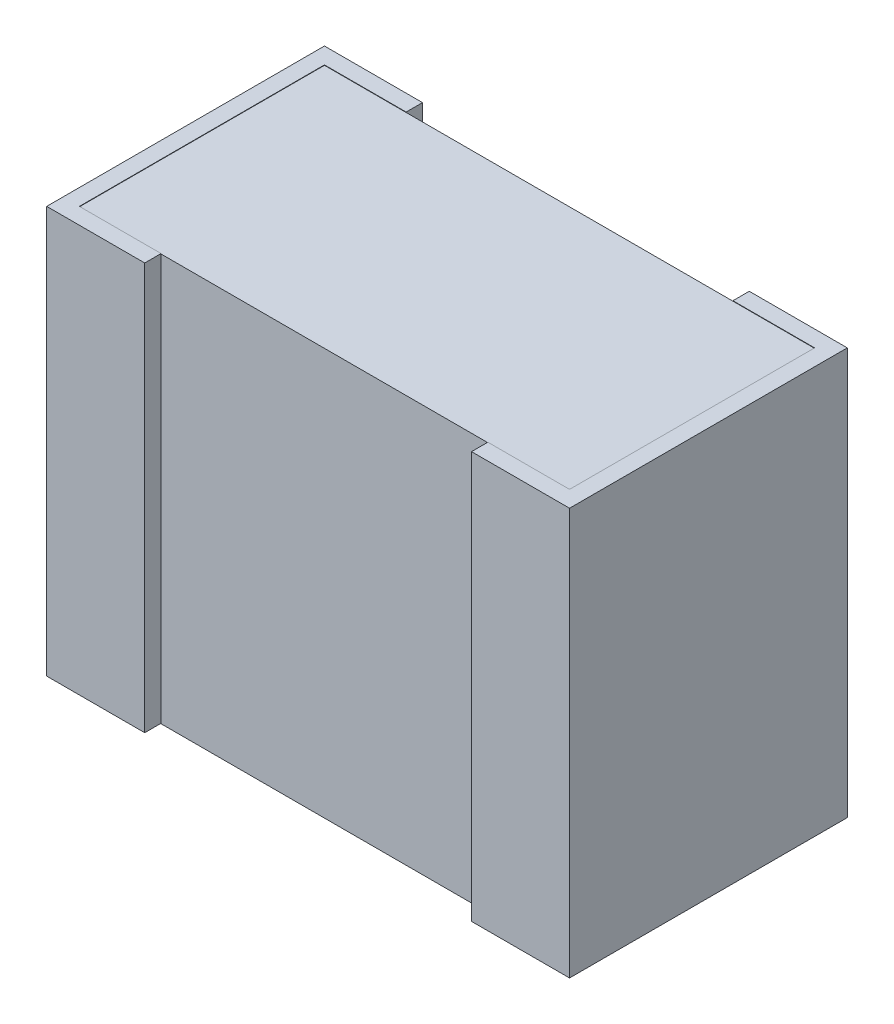
ISO-10303-21;
HEADER;
FILE_DESCRIPTION(('STEP AP214'),'2;1');
FILE_NAME('part.step','',(''),(''),'','','');
FILE_SCHEMA(('AUTOMOTIVE_DESIGN { 1 0 10303 214 1 1 1 1 }'));
ENDSEC;
DATA;
#1=APPLICATION_CONTEXT('core data for automotive mechanical design processes');
#2=APPLICATION_PROTOCOL_DEFINITION('international standard','automotive_design',2000,#1);
#3=PRODUCT_CONTEXT('',#1,'mechanical');
#4=PRODUCT('Part','Part','',(#3));
#5=PRODUCT_RELATED_PRODUCT_CATEGORY('part','',(#4));
#6=PRODUCT_DEFINITION_FORMATION('','',#4);
#7=PRODUCT_DEFINITION_CONTEXT('part definition',#1,'design');
#8=PRODUCT_DEFINITION('design','',#6,#7);
#9=PRODUCT_DEFINITION_SHAPE('','',#8);
#10=(LENGTH_UNIT() NAMED_UNIT(*) SI_UNIT(.MILLI.,.METRE.));
#11=(NAMED_UNIT(*) PLANE_ANGLE_UNIT() SI_UNIT($,.RADIAN.));
#12=(NAMED_UNIT(*) SI_UNIT($,.STERADIAN.) SOLID_ANGLE_UNIT());
#13=UNCERTAINTY_MEASURE_WITH_UNIT(LENGTH_MEASURE(1.E-05),#10,'distance_accuracy_value','');
#14=(GEOMETRIC_REPRESENTATION_CONTEXT(3) GLOBAL_UNCERTAINTY_ASSIGNED_CONTEXT((#13)) GLOBAL_UNIT_ASSIGNED_CONTEXT((#10,
#11,#12)) REPRESENTATION_CONTEXT('',''));
#15=CARTESIAN_POINT('',(0.,0.,0.));
#16=DIRECTION('',(0.,0.,1.));
#17=DIRECTION('',(1.,0.,0.));
#18=AXIS2_PLACEMENT_3D('',#15,#16,#17);
#19=CARTESIAN_POINT('',(-1.5,1.245,0.75));
#20=DIRECTION('',(0.,0.,-1.));
#21=DIRECTION('',(-1.,0.,0.));
#22=AXIS2_PLACEMENT_3D('',#19,#20,#21);
#23=PLANE('',#22);
#24=DIRECTION('',(0.,1.,0.));
#25=VECTOR('',#24,1.);
#26=CARTESIAN_POINT('',(1.,-1.24246,0.75));
#27=LINE('',#26,#25);
#28=CARTESIAN_POINT('',(1.,-1.24246,0.75));
#29=VERTEX_POINT('',#28);
#30=CARTESIAN_POINT('',(1.,1.245,0.75));
#31=VERTEX_POINT('',#30);
#32=EDGE_CURVE('E313',#29,#31,#27,.T.);
#33=ORIENTED_EDGE('',*,*,#32,.T.);
#34=DIRECTION('',(1.,0.,0.));
#35=VECTOR('',#34,1.);
#36=CARTESIAN_POINT('',(-1.5,1.245,0.75));
#37=LINE('',#36,#35);
#38=CARTESIAN_POINT('',(-1.,1.245,0.75));
#39=VERTEX_POINT('',#38);
#40=EDGE_CURVE('E222',#39,#31,#37,.T.);
#41=ORIENTED_EDGE('',*,*,#40,.F.);
#42=DIRECTION('',(0.,1.,0.));
#43=VECTOR('',#42,1.);
#44=CARTESIAN_POINT('',(-1.,-1.24246,0.75));
#45=LINE('',#44,#43);
#46=CARTESIAN_POINT('',(-1.,-1.24246,0.75));
#47=VERTEX_POINT('',#46);
#48=EDGE_CURVE('E59',#47,#39,#45,.T.);
#49=ORIENTED_EDGE('',*,*,#48,.F.);
#50=DIRECTION('',(1.,0.,0.));
#51=VECTOR('',#50,1.);
#52=CARTESIAN_POINT('',(-1.5,-1.24246,0.75));
#53=LINE('',#52,#51);
#54=CARTESIAN_POINT('',(-1.5,-1.24246,0.75));
#55=VERTEX_POINT('',#54);
#56=EDGE_CURVE('E255',#55,#47,#53,.T.);
#57=ORIENTED_EDGE('',*,*,#56,.F.);
#58=DIRECTION('',(0.,-1.,0.));
#59=VECTOR('',#58,1.);
#60=CARTESIAN_POINT('',(-1.5,1.245,0.75));
#61=LINE('',#60,#59);
#62=CARTESIAN_POINT('',(-1.5,-1.245,0.75));
#63=VERTEX_POINT('',#62);
#64=EDGE_CURVE('E11',#55,#63,#61,.T.);
#65=ORIENTED_EDGE('',*,*,#64,.T.);
#66=DIRECTION('',(1.,0.,0.));
#67=VECTOR('',#66,1.);
#68=CARTESIAN_POINT('',(-1.5,-1.245,0.75));
#69=LINE('',#68,#67);
#70=CARTESIAN_POINT('',(1.5,-1.245,0.75));
#71=VERTEX_POINT('',#70);
#72=EDGE_CURVE('E205',#63,#71,#69,.T.);
#73=ORIENTED_EDGE('',*,*,#72,.T.);
#74=DIRECTION('',(0.,-1.,0.));
#75=VECTOR('',#74,1.);
#76=CARTESIAN_POINT('',(1.5,1.245,0.75));
#77=LINE('',#76,#75);
#78=CARTESIAN_POINT('',(1.5,-1.24246,0.75));
#79=VERTEX_POINT('',#78);
#80=EDGE_CURVE('E43',#79,#71,#77,.T.);
#81=ORIENTED_EDGE('',*,*,#80,.F.);
#82=DIRECTION('',(-1.,0.,0.));
#83=VECTOR('',#82,1.);
#84=CARTESIAN_POINT('',(1.5,-1.24246,0.75));
#85=LINE('',#84,#83);
#86=EDGE_CURVE('E183',#79,#29,#85,.T.);
#87=ORIENTED_EDGE('',*,*,#86,.T.);
#88=EDGE_LOOP('',(#33,#41,#49,#57,#65,#73,#81,#87));
#89=FACE_BOUND('',#88,.T.);
#90=ADVANCED_FACE('F34',(#89),#23,.F.);
#91=CARTESIAN_POINT('',(1.5,1.245,-0.75));
#92=DIRECTION('',(1.,0.,0.));
#93=DIRECTION('',(0.,0.,-1.));
#94=AXIS2_PLACEMENT_3D('',#91,#92,#93);
#95=PLANE('',#94);
#96=DIRECTION('',(0.,-1.,0.));
#97=VECTOR('',#96,1.);
#98=CARTESIAN_POINT('',(1.5,1.245,-0.75));
#99=LINE('',#98,#97);
#100=CARTESIAN_POINT('',(1.5,-1.24246,-0.75));
#101=VERTEX_POINT('',#100);
#102=CARTESIAN_POINT('',(1.5,-1.245,-0.75));
#103=VERTEX_POINT('',#102);
#104=EDGE_CURVE('E201',#101,#103,#99,.T.);
#105=ORIENTED_EDGE('',*,*,#104,.F.);
#106=DIRECTION('',(0.,0.,1.));
#107=VECTOR('',#106,1.);
#108=CARTESIAN_POINT('',(1.5,-1.24246,-0.75));
#109=LINE('',#108,#107);
#110=EDGE_CURVE('E187',#101,#79,#109,.T.);
#111=ORIENTED_EDGE('',*,*,#110,.T.);
#112=ORIENTED_EDGE('',*,*,#80,.T.);
#113=DIRECTION('',(0.,0.,1.));
#114=VECTOR('',#113,1.);
#115=CARTESIAN_POINT('',(1.5,-1.245,-0.75));
#116=LINE('',#115,#114);
#117=EDGE_CURVE('E211',#103,#71,#116,.T.);
#118=ORIENTED_EDGE('',*,*,#117,.F.);
#119=EDGE_LOOP('',(#105,#111,#112,#118));
#120=FACE_BOUND('',#119,.T.);
#121=ADVANCED_FACE('F198',(#120),#95,.T.);
#122=CARTESIAN_POINT('',(1.5,1.245,-0.75));
#123=DIRECTION('',(0.,0.,1.));
#124=DIRECTION('',(1.,0.,0.));
#125=AXIS2_PLACEMENT_3D('',#122,#123,#124);
#126=PLANE('',#125);
#127=DIRECTION('',(0.,1.,0.));
#128=VECTOR('',#127,1.);
#129=CARTESIAN_POINT('',(1.,-1.24246,-0.75));
#130=LINE('',#129,#128);
#131=CARTESIAN_POINT('',(1.,-1.24246,-0.75));
#132=VERTEX_POINT('',#131);
#133=CARTESIAN_POINT('',(1.,1.245,-0.75));
#134=VERTEX_POINT('',#133);
#135=EDGE_CURVE('E51',#132,#134,#130,.T.);
#136=ORIENTED_EDGE('',*,*,#135,.F.);
#137=DIRECTION('',(1.,0.,0.));
#138=VECTOR('',#137,1.);
#139=CARTESIAN_POINT('',(1.,-1.24246,-0.75));
#140=LINE('',#139,#138);
#141=EDGE_CURVE('E202',#132,#101,#140,.T.);
#142=ORIENTED_EDGE('',*,*,#141,.T.);
#143=ORIENTED_EDGE('',*,*,#104,.T.);
#144=DIRECTION('',(-1.,0.,0.));
#145=VECTOR('',#144,1.);
#146=CARTESIAN_POINT('',(1.5,-1.245,-0.75));
#147=LINE('',#146,#145);
#148=CARTESIAN_POINT('',(-1.5,-1.245,-0.75));
#149=VERTEX_POINT('',#148);
#150=EDGE_CURVE('E213',#103,#149,#147,.T.);
#151=ORIENTED_EDGE('',*,*,#150,.T.);
#152=DIRECTION('',(0.,-1.,0.));
#153=VECTOR('',#152,1.);
#154=CARTESIAN_POINT('',(-1.5,1.245,-0.75));
#155=LINE('',#154,#153);
#156=CARTESIAN_POINT('',(-1.5,-1.24246,-0.75));
#157=VERTEX_POINT('',#156);
#158=EDGE_CURVE('E38',#157,#149,#155,.T.);
#159=ORIENTED_EDGE('',*,*,#158,.F.);
#160=DIRECTION('',(-1.,0.,0.));
#161=VECTOR('',#160,1.);
#162=CARTESIAN_POINT('',(-1.,-1.24246,-0.75));
#163=LINE('',#162,#161);
#164=CARTESIAN_POINT('',(-1.,-1.24246,-0.75));
#165=VERTEX_POINT('',#164);
#166=EDGE_CURVE('E280',#165,#157,#163,.T.);
#167=ORIENTED_EDGE('',*,*,#166,.F.);
#168=DIRECTION('',(0.,1.,0.));
#169=VECTOR('',#168,1.);
#170=CARTESIAN_POINT('',(-1.,-1.24246,-0.75));
#171=LINE('',#170,#169);
#172=CARTESIAN_POINT('',(-1.,1.245,-0.75));
#173=VERTEX_POINT('',#172);
#174=EDGE_CURVE('E243',#165,#173,#171,.T.);
#175=ORIENTED_EDGE('',*,*,#174,.T.);
#176=DIRECTION('',(-1.,0.,0.));
#177=VECTOR('',#176,1.);
#178=CARTESIAN_POINT('',(1.5,1.245,-0.75));
#179=LINE('',#178,#177);
#180=EDGE_CURVE('E229',#134,#173,#179,.T.);
#181=ORIENTED_EDGE('',*,*,#180,.F.);
#182=EDGE_LOOP('',(#136,#142,#143,#151,#159,#167,#175,#181));
#183=FACE_BOUND('',#182,.T.);
#184=ADVANCED_FACE('F348',(#183),#126,.F.);
#185=CARTESIAN_POINT('',(-1.5,1.245,0.75));
#186=DIRECTION('',(-1.,0.,0.));
#187=DIRECTION('',(0.,0.,1.));
#188=AXIS2_PLACEMENT_3D('',#185,#186,#187);
#189=PLANE('',#188);
#190=ORIENTED_EDGE('',*,*,#64,.F.);
#191=DIRECTION('',(0.,0.,1.));
#192=VECTOR('',#191,1.);
#193=CARTESIAN_POINT('',(-1.5,-1.24246,-0.75));
#194=LINE('',#193,#192);
#195=EDGE_CURVE('E251',#157,#55,#194,.T.);
#196=ORIENTED_EDGE('',*,*,#195,.F.);
#197=ORIENTED_EDGE('',*,*,#158,.T.);
#198=DIRECTION('',(0.,0.,-1.));
#199=VECTOR('',#198,1.);
#200=CARTESIAN_POINT('',(-1.5,-1.245,0.75));
#201=LINE('',#200,#199);
#202=EDGE_CURVE('E216',#63,#149,#201,.T.);
#203=ORIENTED_EDGE('',*,*,#202,.F.);
#204=EDGE_LOOP('',(#190,#196,#197,#203));
#205=FACE_BOUND('',#204,.T.);
#206=ADVANCED_FACE('F36',(#205),#189,.T.);
#207=CARTESIAN_POINT('',(-1.5,1.245,0.75));
#208=DIRECTION('',(0.,-1.,0.));
#209=DIRECTION('',(0.,0.,-1.));
#210=AXIS2_PLACEMENT_3D('',#207,#208,#209);
#211=PLANE('',#210);
#212=DIRECTION('',(0.,0.,-1.));
#213=VECTOR('',#212,1.);
#214=CARTESIAN_POINT('',(-1.5,1.245,0.75));
#215=LINE('',#214,#213);
#216=CARTESIAN_POINT('',(-1.5,1.245,0.75));
#217=VERTEX_POINT('',#216);
#218=CARTESIAN_POINT('',(-1.5,1.245,-0.75));
#219=VERTEX_POINT('',#218);
#220=EDGE_CURVE('E210',#217,#219,#215,.T.);
#221=ORIENTED_EDGE('',*,*,#220,.F.);
#222=EDGE_CURVE('E219',#217,#39,#37,.T.);
#223=ORIENTED_EDGE('',*,*,#222,.T.);
#224=ORIENTED_EDGE('',*,*,#40,.T.);
#225=CARTESIAN_POINT('',(1.5,1.245,0.75));
#226=VERTEX_POINT('',#225);
#227=EDGE_CURVE('E223',#31,#226,#37,.T.);
#228=ORIENTED_EDGE('',*,*,#227,.T.);
#229=DIRECTION('',(0.,0.,1.));
#230=VECTOR('',#229,1.);
#231=CARTESIAN_POINT('',(1.5,1.245,-0.75));
#232=LINE('',#231,#230);
#233=CARTESIAN_POINT('',(1.5,1.245,-0.75));
#234=VERTEX_POINT('',#233);
#235=EDGE_CURVE('E224',#234,#226,#232,.T.);
#236=ORIENTED_EDGE('',*,*,#235,.F.);
#237=EDGE_CURVE('E226',#234,#134,#179,.T.);
#238=ORIENTED_EDGE('',*,*,#237,.T.);
#239=ORIENTED_EDGE('',*,*,#180,.T.);
#240=EDGE_CURVE('E230',#173,#219,#179,.T.);
#241=ORIENTED_EDGE('',*,*,#240,.T.);
#242=EDGE_LOOP('',(#221,#223,#224,#228,#236,#238,#239,#241));
#243=FACE_BOUND('',#242,.T.);
#244=ADVANCED_FACE('F375',(#243),#211,.F.);
#245=CARTESIAN_POINT('',(-1.5,-1.245,0.75));
#246=DIRECTION('',(0.,-1.,0.));
#247=DIRECTION('',(0.,0.,-1.));
#248=AXIS2_PLACEMENT_3D('',#245,#246,#247);
#249=PLANE('',#248);
#250=ORIENTED_EDGE('',*,*,#202,.T.);
#251=ORIENTED_EDGE('',*,*,#150,.F.);
#252=ORIENTED_EDGE('',*,*,#117,.T.);
#253=ORIENTED_EDGE('',*,*,#72,.F.);
#254=EDGE_LOOP('',(#250,#251,#252,#253));
#255=FACE_BOUND('',#254,.T.);
#256=ADVANCED_FACE('F444',(#255),#249,.T.);
#257=CARTESIAN_POINT('',(-1.5,-1.24246,0.75));
#258=DIRECTION('',(0.,0.,1.));
#259=DIRECTION('',(1.,0.,0.));
#260=AXIS2_PLACEMENT_3D('',#257,#258,#259);
#261=PLANE('',#260);
#262=CARTESIAN_POINT('',(-1.,1.24754,0.75));
#263=VERTEX_POINT('',#262);
#264=EDGE_CURVE('E234',#39,#263,#45,.T.);
#265=ORIENTED_EDGE('',*,*,#264,.F.);
#266=ORIENTED_EDGE('',*,*,#222,.F.);
#267=DIRECTION('',(0.,1.,0.));
#268=VECTOR('',#267,1.);
#269=CARTESIAN_POINT('',(-1.5,-1.24246,0.75));
#270=LINE('',#269,#268);
#271=CARTESIAN_POINT('',(-1.5,1.24754,0.75));
#272=VERTEX_POINT('',#271);
#273=EDGE_CURVE('E249',#217,#272,#270,.T.);
#274=ORIENTED_EDGE('',*,*,#273,.T.);
#275=DIRECTION('',(1.,0.,0.));
#276=VECTOR('',#275,1.);
#277=CARTESIAN_POINT('',(-1.5,1.24754,0.75));
#278=LINE('',#277,#276);
#279=EDGE_CURVE('E274',#272,#263,#278,.T.);
#280=ORIENTED_EDGE('',*,*,#279,.T.);
#281=EDGE_LOOP('',(#265,#266,#274,#280));
#282=FACE_BOUND('',#281,.T.);
#283=ADVANCED_FACE('F381',(#282),#261,.F.);
#284=CARTESIAN_POINT('',(-1.,-1.24246,-0.75));
#285=DIRECTION('',(0.,0.,-1.));
#286=DIRECTION('',(-1.,0.,0.));
#287=AXIS2_PLACEMENT_3D('',#284,#285,#286);
#288=PLANE('',#287);
#289=DIRECTION('',(0.,1.,0.));
#290=VECTOR('',#289,1.);
#291=CARTESIAN_POINT('',(-1.5,-1.24246,-0.75));
#292=LINE('',#291,#290);
#293=CARTESIAN_POINT('',(-1.5,1.24754,-0.75));
#294=VERTEX_POINT('',#293);
#295=EDGE_CURVE('E247',#219,#294,#292,.T.);
#296=ORIENTED_EDGE('',*,*,#295,.F.);
#297=ORIENTED_EDGE('',*,*,#240,.F.);
#298=CARTESIAN_POINT('',(-1.,1.24754,-0.75));
#299=VERTEX_POINT('',#298);
#300=EDGE_CURVE('E246',#173,#299,#171,.T.);
#301=ORIENTED_EDGE('',*,*,#300,.T.);
#302=DIRECTION('',(-1.,0.,0.));
#303=VECTOR('',#302,1.);
#304=CARTESIAN_POINT('',(-1.,1.24754,-0.75));
#305=LINE('',#304,#303);
#306=EDGE_CURVE('E256',#299,#294,#305,.T.);
#307=ORIENTED_EDGE('',*,*,#306,.T.);
#308=EDGE_LOOP('',(#296,#297,#301,#307));
#309=FACE_BOUND('',#308,.T.);
#310=ADVANCED_FACE('F411',(#309),#288,.F.);
#311=CARTESIAN_POINT('',(-1.5,-1.24246,-0.75));
#312=DIRECTION('',(-1.,0.,0.));
#313=DIRECTION('',(0.,0.,1.));
#314=AXIS2_PLACEMENT_3D('',#311,#312,#313);
#315=PLANE('',#314);
#316=ORIENTED_EDGE('',*,*,#273,.F.);
#317=ORIENTED_EDGE('',*,*,#220,.T.);
#318=ORIENTED_EDGE('',*,*,#295,.T.);
#319=DIRECTION('',(0.,0.,1.));
#320=VECTOR('',#319,1.);
#321=CARTESIAN_POINT('',(-1.5,1.24754,-0.75));
#322=LINE('',#321,#320);
#323=EDGE_CURVE('E252',#294,#272,#322,.T.);
#324=ORIENTED_EDGE('',*,*,#323,.T.);
#325=EDGE_LOOP('',(#316,#317,#318,#324));
#326=FACE_BOUND('',#325,.T.);
#327=ADVANCED_FACE('F465',(#326),#315,.F.);
#328=CARTESIAN_POINT('',(-1.,-1.24246,0.85));
#329=DIRECTION('',(1.,0.,0.));
#330=DIRECTION('',(0.,0.,-1.));
#331=AXIS2_PLACEMENT_3D('',#328,#329,#330);
#332=PLANE('',#331);
#333=DIRECTION('',(0.,0.,-1.));
#334=VECTOR('',#333,1.);
#335=CARTESIAN_POINT('',(-1.,1.24754,0.85));
#336=LINE('',#335,#334);
#337=CARTESIAN_POINT('',(-1.,1.24754,0.85));
#338=VERTEX_POINT('',#337);
#339=EDGE_CURVE('E271',#338,#263,#336,.T.);
#340=ORIENTED_EDGE('',*,*,#339,.F.);
#341=DIRECTION('',(0.,1.,0.));
#342=VECTOR('',#341,1.);
#343=CARTESIAN_POINT('',(-1.,-1.24246,0.85));
#344=LINE('',#343,#342);
#345=CARTESIAN_POINT('',(-1.,-1.24246,0.85));
#346=VERTEX_POINT('',#345);
#347=EDGE_CURVE('E235',#346,#338,#344,.T.);
#348=ORIENTED_EDGE('',*,*,#347,.F.);
#349=DIRECTION('',(0.,0.,-1.));
#350=VECTOR('',#349,1.);
#351=CARTESIAN_POINT('',(-1.,-1.24246,0.85));
#352=LINE('',#351,#350);
#353=EDGE_CURVE('E294',#346,#47,#352,.T.);
#354=ORIENTED_EDGE('',*,*,#353,.T.);
#355=ORIENTED_EDGE('',*,*,#48,.T.);
#356=ORIENTED_EDGE('',*,*,#264,.T.);
#357=EDGE_LOOP('',(#340,#348,#354,#355,#356));
#358=FACE_BOUND('',#357,.T.);
#359=ADVANCED_FACE('F385',(#358),#332,.T.);
#360=CARTESIAN_POINT('',(-1.6,-1.24246,0.85));
#361=DIRECTION('',(0.,0.,1.));
#362=DIRECTION('',(1.,0.,0.));
#363=AXIS2_PLACEMENT_3D('',#360,#361,#362);
#364=PLANE('',#363);
#365=DIRECTION('',(1.,0.,0.));
#366=VECTOR('',#365,1.);
#367=CARTESIAN_POINT('',(-1.6,1.24754,0.85));
#368=LINE('',#367,#366);
#369=CARTESIAN_POINT('',(-1.6,1.24754,0.85));
#370=VERTEX_POINT('',#369);
#371=EDGE_CURVE('E268',#370,#338,#368,.T.);
#372=ORIENTED_EDGE('',*,*,#371,.F.);
#373=DIRECTION('',(0.,1.,0.));
#374=VECTOR('',#373,1.);
#375=CARTESIAN_POINT('',(-1.6,-1.24246,0.85));
#376=LINE('',#375,#374);
#377=CARTESIAN_POINT('',(-1.6,-1.24246,0.85));
#378=VERTEX_POINT('',#377);
#379=EDGE_CURVE('E237',#378,#370,#376,.T.);
#380=ORIENTED_EDGE('',*,*,#379,.F.);
#381=DIRECTION('',(1.,0.,0.));
#382=VECTOR('',#381,1.);
#383=CARTESIAN_POINT('',(-1.6,-1.24246,0.85));
#384=LINE('',#383,#382);
#385=EDGE_CURVE('E291',#378,#346,#384,.T.);
#386=ORIENTED_EDGE('',*,*,#385,.T.);
#387=ORIENTED_EDGE('',*,*,#347,.T.);
#388=EDGE_LOOP('',(#372,#380,#386,#387));
#389=FACE_BOUND('',#388,.T.);
#390=ADVANCED_FACE('F392',(#389),#364,.T.);
#391=CARTESIAN_POINT('',(-1.6,-1.24246,0.85));
#392=DIRECTION('',(1.,0.,0.));
#393=DIRECTION('',(0.,0.,-1.));
#394=AXIS2_PLACEMENT_3D('',#391,#392,#393);
#395=PLANE('',#394);
#396=DIRECTION('',(0.,0.,-1.));
#397=VECTOR('',#396,1.);
#398=CARTESIAN_POINT('',(-1.6,1.24754,0.85));
#399=LINE('',#398,#397);
#400=CARTESIAN_POINT('',(-1.6,1.24754,-0.85));
#401=VERTEX_POINT('',#400);
#402=EDGE_CURVE('E265',#370,#401,#399,.T.);
#403=ORIENTED_EDGE('',*,*,#402,.T.);
#404=DIRECTION('',(0.,1.,0.));
#405=VECTOR('',#404,1.);
#406=CARTESIAN_POINT('',(-1.6,-1.24246,-0.85));
#407=LINE('',#406,#405);
#408=CARTESIAN_POINT('',(-1.6,-1.24246,-0.85));
#409=VERTEX_POINT('',#408);
#410=EDGE_CURVE('E239',#409,#401,#407,.T.);
#411=ORIENTED_EDGE('',*,*,#410,.F.);
#412=DIRECTION('',(0.,0.,-1.));
#413=VECTOR('',#412,1.);
#414=CARTESIAN_POINT('',(-1.6,-1.24246,0.85));
#415=LINE('',#414,#413);
#416=EDGE_CURVE('E289',#378,#409,#415,.T.);
#417=ORIENTED_EDGE('',*,*,#416,.F.);
#418=ORIENTED_EDGE('',*,*,#379,.T.);
#419=EDGE_LOOP('',(#403,#411,#417,#418));
#420=FACE_BOUND('',#419,.T.);
#421=ADVANCED_FACE('F397',(#420),#395,.F.);
#422=CARTESIAN_POINT('',(-1.,-1.24246,-0.85));
#423=DIRECTION('',(0.,0.,-1.));
#424=DIRECTION('',(-1.,0.,0.));
#425=AXIS2_PLACEMENT_3D('',#422,#423,#424);
#426=PLANE('',#425);
#427=DIRECTION('',(-1.,0.,0.));
#428=VECTOR('',#427,1.);
#429=CARTESIAN_POINT('',(-1.,1.24754,-0.85));
#430=LINE('',#429,#428);
#431=CARTESIAN_POINT('',(-1.,1.24754,-0.85));
#432=VERTEX_POINT('',#431);
#433=EDGE_CURVE('E262',#432,#401,#430,.T.);
#434=ORIENTED_EDGE('',*,*,#433,.F.);
#435=DIRECTION('',(0.,1.,0.));
#436=VECTOR('',#435,1.);
#437=CARTESIAN_POINT('',(-1.,-1.24246,-0.85));
#438=LINE('',#437,#436);
#439=CARTESIAN_POINT('',(-1.,-1.24246,-0.85));
#440=VERTEX_POINT('',#439);
#441=EDGE_CURVE('E241',#440,#432,#438,.T.);
#442=ORIENTED_EDGE('',*,*,#441,.F.);
#443=DIRECTION('',(-1.,0.,0.));
#444=VECTOR('',#443,1.);
#445=CARTESIAN_POINT('',(-1.,-1.24246,-0.85));
#446=LINE('',#445,#444);
#447=EDGE_CURVE('E286',#440,#409,#446,.T.);
#448=ORIENTED_EDGE('',*,*,#447,.T.);
#449=ORIENTED_EDGE('',*,*,#410,.T.);
#450=EDGE_LOOP('',(#434,#442,#448,#449));
#451=FACE_BOUND('',#450,.T.);
#452=ADVANCED_FACE('F474',(#451),#426,.T.);
#453=CARTESIAN_POINT('',(-1.,-1.24246,-0.75));
#454=DIRECTION('',(1.,0.,0.));
#455=DIRECTION('',(0.,0.,-1.));
#456=AXIS2_PLACEMENT_3D('',#453,#454,#455);
#457=PLANE('',#456);
#458=DIRECTION('',(0.,0.,-1.));
#459=VECTOR('',#458,1.);
#460=CARTESIAN_POINT('',(-1.,1.24754,-0.75));
#461=LINE('',#460,#459);
#462=EDGE_CURVE('E259',#299,#432,#461,.T.);
#463=ORIENTED_EDGE('',*,*,#462,.F.);
#464=ORIENTED_EDGE('',*,*,#300,.F.);
#465=ORIENTED_EDGE('',*,*,#174,.F.);
#466=DIRECTION('',(0.,0.,-1.));
#467=VECTOR('',#466,1.);
#468=CARTESIAN_POINT('',(-1.,-1.24246,-0.75));
#469=LINE('',#468,#467);
#470=EDGE_CURVE('E283',#165,#440,#469,.T.);
#471=ORIENTED_EDGE('',*,*,#470,.T.);
#472=ORIENTED_EDGE('',*,*,#441,.T.);
#473=EDGE_LOOP('',(#463,#464,#465,#471,#472));
#474=FACE_BOUND('',#473,.T.);
#475=ADVANCED_FACE('F404',(#474),#457,.T.);
#476=CARTESIAN_POINT('',(-1.6,-1.24246,0.75));
#477=DIRECTION('',(0.,1.,0.));
#478=DIRECTION('',(0.,0.,1.));
#479=AXIS2_PLACEMENT_3D('',#476,#477,#478);
#480=PLANE('',#479);
#481=ORIENTED_EDGE('',*,*,#56,.T.);
#482=ORIENTED_EDGE('',*,*,#353,.F.);
#483=ORIENTED_EDGE('',*,*,#385,.F.);
#484=ORIENTED_EDGE('',*,*,#416,.T.);
#485=ORIENTED_EDGE('',*,*,#447,.F.);
#486=ORIENTED_EDGE('',*,*,#470,.F.);
#487=ORIENTED_EDGE('',*,*,#166,.T.);
#488=ORIENTED_EDGE('',*,*,#195,.T.);
#489=EDGE_LOOP('',(#481,#482,#483,#484,#485,#486,#487,#488));
#490=FACE_BOUND('',#489,.T.);
#491=ADVANCED_FACE('F389',(#490),#480,.F.);
#492=CARTESIAN_POINT('',(-1.6,1.24754,0.75));
#493=DIRECTION('',(0.,1.,0.));
#494=DIRECTION('',(0.,0.,1.));
#495=AXIS2_PLACEMENT_3D('',#492,#493,#494);
#496=PLANE('',#495);
#497=ORIENTED_EDGE('',*,*,#279,.F.);
#498=ORIENTED_EDGE('',*,*,#323,.F.);
#499=ORIENTED_EDGE('',*,*,#306,.F.);
#500=ORIENTED_EDGE('',*,*,#462,.T.);
#501=ORIENTED_EDGE('',*,*,#433,.T.);
#502=ORIENTED_EDGE('',*,*,#402,.F.);
#503=ORIENTED_EDGE('',*,*,#371,.T.);
#504=ORIENTED_EDGE('',*,*,#339,.T.);
#505=EDGE_LOOP('',(#497,#498,#499,#500,#501,#502,#503,#504));
#506=FACE_BOUND('',#505,.T.);
#507=ADVANCED_FACE('F427',(#506),#496,.T.);
#508=CARTESIAN_POINT('',(1.5,-1.24246,0.75));
#509=DIRECTION('',(0.,0.,-1.));
#510=DIRECTION('',(-1.,0.,0.));
#511=AXIS2_PLACEMENT_3D('',#508,#509,#510);
#512=PLANE('',#511);
#513=ORIENTED_EDGE('',*,*,#227,.F.);
#514=CARTESIAN_POINT('',(1.,1.24754,0.75));
#515=VERTEX_POINT('',#514);
#516=EDGE_CURVE('E315',#31,#515,#27,.T.);
#517=ORIENTED_EDGE('',*,*,#516,.T.);
#518=DIRECTION('',(-1.,0.,0.));
#519=VECTOR('',#518,1.);
#520=CARTESIAN_POINT('',(1.5,1.24754,0.75));
#521=LINE('',#520,#519);
#522=CARTESIAN_POINT('',(1.5,1.24754,0.75));
#523=VERTEX_POINT('',#522);
#524=EDGE_CURVE('E334',#523,#515,#521,.T.);
#525=ORIENTED_EDGE('',*,*,#524,.F.);
#526=DIRECTION('',(0.,1.,0.));
#527=VECTOR('',#526,1.);
#528=CARTESIAN_POINT('',(1.5,-1.24246,0.75));
#529=LINE('',#528,#527);
#530=EDGE_CURVE('E277',#226,#523,#529,.T.);
#531=ORIENTED_EDGE('',*,*,#530,.F.);
#532=EDGE_LOOP('',(#513,#517,#525,#531));
#533=FACE_BOUND('',#532,.T.);
#534=ADVANCED_FACE('F425',(#533),#512,.T.);
#535=CARTESIAN_POINT('',(1.5,-1.24246,-0.75));
#536=DIRECTION('',(-1.,0.,0.));
#537=DIRECTION('',(0.,0.,1.));
#538=AXIS2_PLACEMENT_3D('',#535,#536,#537);
#539=PLANE('',#538);
#540=ORIENTED_EDGE('',*,*,#235,.T.);
#541=ORIENTED_EDGE('',*,*,#530,.T.);
#542=DIRECTION('',(0.,0.,1.));
#543=VECTOR('',#542,1.);
#544=CARTESIAN_POINT('',(1.5,1.24754,-0.75));
#545=LINE('',#544,#543);
#546=CARTESIAN_POINT('',(1.5,1.24754,-0.75));
#547=VERTEX_POINT('',#546);
#548=EDGE_CURVE('E331',#547,#523,#545,.T.);
#549=ORIENTED_EDGE('',*,*,#548,.F.);
#550=DIRECTION('',(0.,1.,0.));
#551=VECTOR('',#550,1.);
#552=CARTESIAN_POINT('',(1.5,-1.24246,-0.75));
#553=LINE('',#552,#551);
#554=EDGE_CURVE('E299',#234,#547,#553,.T.);
#555=ORIENTED_EDGE('',*,*,#554,.F.);
#556=EDGE_LOOP('',(#540,#541,#549,#555));
#557=FACE_BOUND('',#556,.T.);
#558=ADVANCED_FACE('F419',(#557),#539,.T.);
#559=CARTESIAN_POINT('',(1.,-1.24246,-0.75));
#560=DIRECTION('',(0.,0.,1.));
#561=DIRECTION('',(1.,0.,0.));
#562=AXIS2_PLACEMENT_3D('',#559,#560,#561);
#563=PLANE('',#562);
#564=ORIENTED_EDGE('',*,*,#237,.F.);
#565=ORIENTED_EDGE('',*,*,#554,.T.);
#566=DIRECTION('',(1.,0.,0.));
#567=VECTOR('',#566,1.);
#568=CARTESIAN_POINT('',(1.,1.24754,-0.75));
#569=LINE('',#568,#567);
#570=CARTESIAN_POINT('',(1.,1.24754,-0.75));
#571=VERTEX_POINT('',#570);
#572=EDGE_CURVE('E328',#571,#547,#569,.T.);
#573=ORIENTED_EDGE('',*,*,#572,.F.);
#574=EDGE_CURVE('E302',#134,#571,#130,.T.);
#575=ORIENTED_EDGE('',*,*,#574,.F.);
#576=EDGE_LOOP('',(#564,#565,#573,#575));
#577=FACE_BOUND('',#576,.T.);
#578=ADVANCED_FACE('F415',(#577),#563,.T.);
#579=CARTESIAN_POINT('',(1.,-1.24246,-0.75));
#580=DIRECTION('',(1.,0.,0.));
#581=DIRECTION('',(0.,0.,-1.));
#582=AXIS2_PLACEMENT_3D('',#579,#580,#581);
#583=PLANE('',#582);
#584=DIRECTION('',(0.,0.,-1.));
#585=VECTOR('',#584,1.);
#586=CARTESIAN_POINT('',(1.,1.24754,-0.75));
#587=LINE('',#586,#585);
#588=CARTESIAN_POINT('',(1.,1.24754,-0.85));
#589=VERTEX_POINT('',#588);
#590=EDGE_CURVE('E326',#571,#589,#587,.T.);
#591=ORIENTED_EDGE('',*,*,#590,.T.);
#592=DIRECTION('',(0.,1.,0.));
#593=VECTOR('',#592,1.);
#594=CARTESIAN_POINT('',(1.,-1.24246,-0.85));
#595=LINE('',#594,#593);
#596=CARTESIAN_POINT('',(1.,-1.24246,-0.85));
#597=VERTEX_POINT('',#596);
#598=EDGE_CURVE('E303',#597,#589,#595,.T.);
#599=ORIENTED_EDGE('',*,*,#598,.F.);
#600=DIRECTION('',(0.,0.,-1.));
#601=VECTOR('',#600,1.);
#602=CARTESIAN_POINT('',(1.,-1.24246,-0.75));
#603=LINE('',#602,#601);
#604=EDGE_CURVE('E345',#132,#597,#603,.T.);
#605=ORIENTED_EDGE('',*,*,#604,.F.);
#606=ORIENTED_EDGE('',*,*,#135,.T.);
#607=ORIENTED_EDGE('',*,*,#574,.T.);
#608=EDGE_LOOP('',(#591,#599,#605,#606,#607));
#609=FACE_BOUND('',#608,.T.);
#610=ADVANCED_FACE('F355',(#609),#583,.F.);
#611=CARTESIAN_POINT('',(1.,-1.24246,-0.85));
#612=DIRECTION('',(0.,0.,1.));
#613=DIRECTION('',(1.,0.,0.));
#614=AXIS2_PLACEMENT_3D('',#611,#612,#613);
#615=PLANE('',#614);
#616=DIRECTION('',(1.,0.,0.));
#617=VECTOR('',#616,1.);
#618=CARTESIAN_POINT('',(1.,1.24754,-0.85));
#619=LINE('',#618,#617);
#620=CARTESIAN_POINT('',(1.6,1.24754,-0.85));
#621=VERTEX_POINT('',#620);
#622=EDGE_CURVE('E323',#589,#621,#619,.T.);
#623=ORIENTED_EDGE('',*,*,#622,.T.);
#624=DIRECTION('',(0.,1.,0.));
#625=VECTOR('',#624,1.);
#626=CARTESIAN_POINT('',(1.6,-1.24246,-0.85));
#627=LINE('',#626,#625);
#628=CARTESIAN_POINT('',(1.6,-1.24246,-0.85));
#629=VERTEX_POINT('',#628);
#630=EDGE_CURVE('E306',#629,#621,#627,.T.);
#631=ORIENTED_EDGE('',*,*,#630,.F.);
#632=DIRECTION('',(1.,0.,0.));
#633=VECTOR('',#632,1.);
#634=CARTESIAN_POINT('',(1.,-1.24246,-0.85));
#635=LINE('',#634,#633);
#636=EDGE_CURVE('E343',#597,#629,#635,.T.);
#637=ORIENTED_EDGE('',*,*,#636,.F.);
#638=ORIENTED_EDGE('',*,*,#598,.T.);
#639=EDGE_LOOP('',(#623,#631,#637,#638));
#640=FACE_BOUND('',#639,.T.);
#641=ADVANCED_FACE('F359',(#640),#615,.F.);
#642=CARTESIAN_POINT('',(1.6,-1.24246,0.85));
#643=DIRECTION('',(1.,0.,0.));
#644=DIRECTION('',(0.,0.,-1.));
#645=AXIS2_PLACEMENT_3D('',#642,#643,#644);
#646=PLANE('',#645);
#647=DIRECTION('',(0.,0.,-1.));
#648=VECTOR('',#647,1.);
#649=CARTESIAN_POINT('',(1.6,1.24754,0.85));
#650=LINE('',#649,#648);
#651=CARTESIAN_POINT('',(1.6,1.24754,0.85));
#652=VERTEX_POINT('',#651);
#653=EDGE_CURVE('E320',#652,#621,#650,.T.);
#654=ORIENTED_EDGE('',*,*,#653,.F.);
#655=DIRECTION('',(0.,1.,0.));
#656=VECTOR('',#655,1.);
#657=CARTESIAN_POINT('',(1.6,-1.24246,0.85));
#658=LINE('',#657,#656);
#659=CARTESIAN_POINT('',(1.6,-1.24246,0.85));
#660=VERTEX_POINT('',#659);
#661=EDGE_CURVE('E308',#660,#652,#658,.T.);
#662=ORIENTED_EDGE('',*,*,#661,.F.);
#663=DIRECTION('',(0.,0.,-1.));
#664=VECTOR('',#663,1.);
#665=CARTESIAN_POINT('',(1.6,-1.24246,0.85));
#666=LINE('',#665,#664);
#667=EDGE_CURVE('E340',#660,#629,#666,.T.);
#668=ORIENTED_EDGE('',*,*,#667,.T.);
#669=ORIENTED_EDGE('',*,*,#630,.T.);
#670=EDGE_LOOP('',(#654,#662,#668,#669));
#671=FACE_BOUND('',#670,.T.);
#672=ADVANCED_FACE('F362',(#671),#646,.T.);
#673=CARTESIAN_POINT('',(1.6,-1.24246,0.85));
#674=DIRECTION('',(0.,0.,-1.));
#675=DIRECTION('',(-1.,0.,0.));
#676=AXIS2_PLACEMENT_3D('',#673,#674,#675);
#677=PLANE('',#676);
#678=DIRECTION('',(-1.,0.,0.));
#679=VECTOR('',#678,1.);
#680=CARTESIAN_POINT('',(1.6,1.24754,0.85));
#681=LINE('',#680,#679);
#682=CARTESIAN_POINT('',(1.,1.24754,0.85));
#683=VERTEX_POINT('',#682);
#684=EDGE_CURVE('E318',#652,#683,#681,.T.);
#685=ORIENTED_EDGE('',*,*,#684,.T.);
#686=DIRECTION('',(0.,1.,0.));
#687=VECTOR('',#686,1.);
#688=CARTESIAN_POINT('',(1.,-1.24246,0.85));
#689=LINE('',#688,#687);
#690=CARTESIAN_POINT('',(1.,-1.24246,0.85));
#691=VERTEX_POINT('',#690);
#692=EDGE_CURVE('E310',#691,#683,#689,.T.);
#693=ORIENTED_EDGE('',*,*,#692,.F.);
#694=DIRECTION('',(-1.,0.,0.));
#695=VECTOR('',#694,1.);
#696=CARTESIAN_POINT('',(1.6,-1.24246,0.85));
#697=LINE('',#696,#695);
#698=EDGE_CURVE('E338',#660,#691,#697,.T.);
#699=ORIENTED_EDGE('',*,*,#698,.F.);
#700=ORIENTED_EDGE('',*,*,#661,.T.);
#701=EDGE_LOOP('',(#685,#693,#699,#700));
#702=FACE_BOUND('',#701,.T.);
#703=ADVANCED_FACE('F366',(#702),#677,.F.);
#704=CARTESIAN_POINT('',(1.,-1.24246,0.85));
#705=DIRECTION('',(1.,0.,0.));
#706=DIRECTION('',(0.,0.,-1.));
#707=AXIS2_PLACEMENT_3D('',#704,#705,#706);
#708=PLANE('',#707);
#709=DIRECTION('',(0.,0.,-1.));
#710=VECTOR('',#709,1.);
#711=CARTESIAN_POINT('',(1.,1.24754,0.85));
#712=LINE('',#711,#710);
#713=EDGE_CURVE('E194',#683,#515,#712,.T.);
#714=ORIENTED_EDGE('',*,*,#713,.T.);
#715=ORIENTED_EDGE('',*,*,#516,.F.);
#716=ORIENTED_EDGE('',*,*,#32,.F.);
#717=DIRECTION('',(0.,0.,-1.));
#718=VECTOR('',#717,1.);
#719=CARTESIAN_POINT('',(1.,-1.24246,0.85));
#720=LINE('',#719,#718);
#721=EDGE_CURVE('E190',#691,#29,#720,.T.);
#722=ORIENTED_EDGE('',*,*,#721,.F.);
#723=ORIENTED_EDGE('',*,*,#692,.T.);
#724=EDGE_LOOP('',(#714,#715,#716,#722,#723));
#725=FACE_BOUND('',#724,.T.);
#726=ADVANCED_FACE('F370',(#725),#708,.F.);
#727=CARTESIAN_POINT('',(1.6,-1.24246,0.75));
#728=DIRECTION('',(0.,1.,0.));
#729=DIRECTION('',(0.,0.,1.));
#730=AXIS2_PLACEMENT_3D('',#727,#728,#729);
#731=PLANE('',#730);
#732=ORIENTED_EDGE('',*,*,#86,.F.);
#733=ORIENTED_EDGE('',*,*,#110,.F.);
#734=ORIENTED_EDGE('',*,*,#141,.F.);
#735=ORIENTED_EDGE('',*,*,#604,.T.);
#736=ORIENTED_EDGE('',*,*,#636,.T.);
#737=ORIENTED_EDGE('',*,*,#667,.F.);
#738=ORIENTED_EDGE('',*,*,#698,.T.);
#739=ORIENTED_EDGE('',*,*,#721,.T.);
#740=EDGE_LOOP('',(#732,#733,#734,#735,#736,#737,#738,#739));
#741=FACE_BOUND('',#740,.T.);
#742=ADVANCED_FACE('F185',(#741),#731,.F.);
#743=CARTESIAN_POINT('',(1.6,1.24754,0.75));
#744=DIRECTION('',(0.,1.,0.));
#745=DIRECTION('',(0.,0.,1.));
#746=AXIS2_PLACEMENT_3D('',#743,#744,#745);
#747=PLANE('',#746);
#748=ORIENTED_EDGE('',*,*,#524,.T.);
#749=ORIENTED_EDGE('',*,*,#713,.F.);
#750=ORIENTED_EDGE('',*,*,#684,.F.);
#751=ORIENTED_EDGE('',*,*,#653,.T.);
#752=ORIENTED_EDGE('',*,*,#622,.F.);
#753=ORIENTED_EDGE('',*,*,#590,.F.);
#754=ORIENTED_EDGE('',*,*,#572,.T.);
#755=ORIENTED_EDGE('',*,*,#548,.T.);
#756=EDGE_LOOP('',(#748,#749,#750,#751,#752,#753,#754,#755));
#757=FACE_BOUND('',#756,.T.);
#758=ADVANCED_FACE('F423',(#757),#747,.T.);
#759=CLOSED_SHELL('',(#90,#121,#184,#206,#244,#256,#283,#310,#327,#359,#390,#421,#452,#475,#491,
#507,#534,#558,#578,#610,#641,#672,#703,#726,#742,#758));
#760=MANIFOLD_SOLID_BREP('B2',#759);
#761=ADVANCED_BREP_SHAPE_REPRESENTATION('',(#18,#760),#14);
#762=SHAPE_DEFINITION_REPRESENTATION(#9,#761);
ENDSEC;
END-ISO-10303-21;
